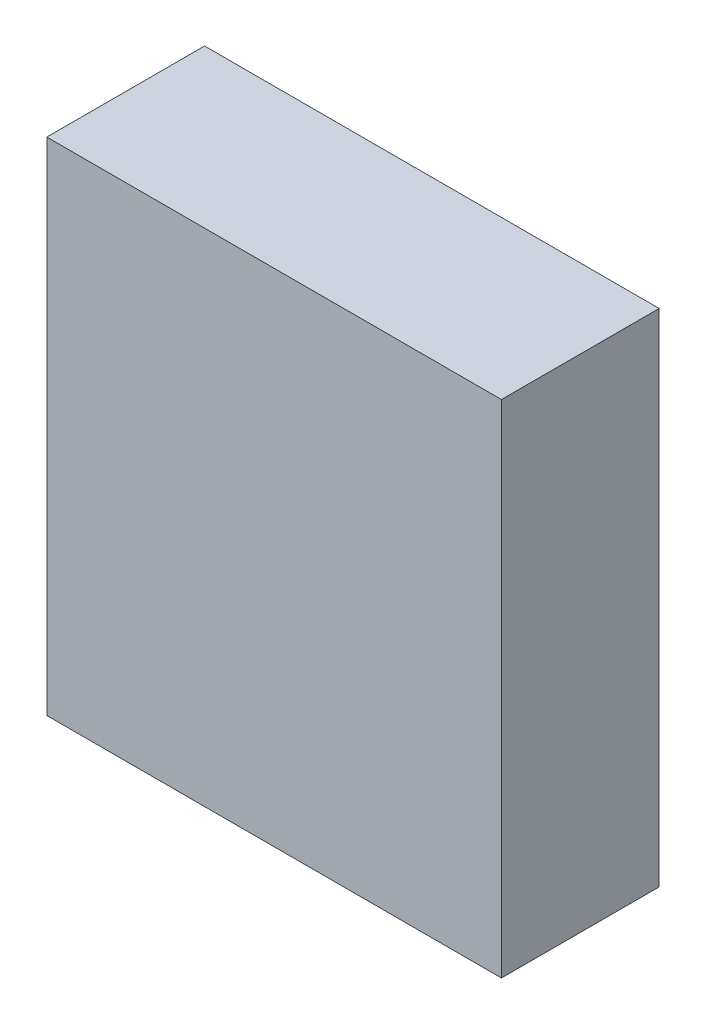
ISO-10303-21;
HEADER;
FILE_DESCRIPTION(('STEP AP214'),'2;1');
FILE_NAME('part.step','',(''),(''),'','','');
FILE_SCHEMA(('AUTOMOTIVE_DESIGN { 1 0 10303 214 1 1 1 1 }'));
ENDSEC;
DATA;
#1=APPLICATION_CONTEXT('core data for automotive mechanical design processes');
#2=APPLICATION_PROTOCOL_DEFINITION('international standard','automotive_design',2000,#1);
#3=PRODUCT_CONTEXT('',#1,'mechanical');
#4=PRODUCT('Part','Part','',(#3));
#5=PRODUCT_RELATED_PRODUCT_CATEGORY('part','',(#4));
#6=PRODUCT_DEFINITION_FORMATION('','',#4);
#7=PRODUCT_DEFINITION_CONTEXT('part definition',#1,'design');
#8=PRODUCT_DEFINITION('design','',#6,#7);
#9=PRODUCT_DEFINITION_SHAPE('','',#8);
#10=(LENGTH_UNIT() NAMED_UNIT(*) SI_UNIT(.MILLI.,.METRE.));
#11=(NAMED_UNIT(*) PLANE_ANGLE_UNIT() SI_UNIT($,.RADIAN.));
#12=(NAMED_UNIT(*) SI_UNIT($,.STERADIAN.) SOLID_ANGLE_UNIT());
#13=UNCERTAINTY_MEASURE_WITH_UNIT(LENGTH_MEASURE(1.E-05),#10,'distance_accuracy_value','');
#14=(GEOMETRIC_REPRESENTATION_CONTEXT(3) GLOBAL_UNCERTAINTY_ASSIGNED_CONTEXT((#13)) GLOBAL_UNIT_ASSIGNED_CONTEXT((#10,
#11,#12)) REPRESENTATION_CONTEXT('',''));
#15=CARTESIAN_POINT('',(0.,0.,0.));
#16=DIRECTION('',(0.,0.,1.));
#17=DIRECTION('',(1.,0.,0.));
#18=AXIS2_PLACEMENT_3D('',#15,#16,#17);
#19=CARTESIAN_POINT('',(-2.44999942429962,2.69998250302808,0.));
#20=DIRECTION('',(-1.,1.19248806385031E-08,0.));
#21=DIRECTION('',(-1.19248806385031E-08,-1.,0.));
#22=AXIS2_PLACEMENT_3D('',#19,#20,#21);
#23=PLANE('',#22);
#24=DIRECTION('',(-1.19248806627069E-08,-1.,0.));
#25=VECTOR('',#24,1.);
#26=CARTESIAN_POINT('',(-2.44999942429962,2.69998250302808,0.));
#27=LINE('',#26,#25);
#28=CARTESIAN_POINT('',(-2.44999942429962,2.69998250302808,0.));
#29=VERTEX_POINT('',#28);
#30=CARTESIAN_POINT('',(-2.4499994886939,-2.70001139345629,0.));
#31=VERTEX_POINT('',#30);
#32=EDGE_CURVE('E11',#29,#31,#27,.T.);
#33=ORIENTED_EDGE('',*,*,#32,.T.);
#34=DIRECTION('',(0.,0.,1.));
#35=VECTOR('',#34,1.);
#36=CARTESIAN_POINT('',(-2.4499994886939,-2.70001139345629,0.));
#37=LINE('',#36,#35);
#38=CARTESIAN_POINT('',(-2.4499994886939,-2.70001139345629,1.6999990940094));
#39=VERTEX_POINT('',#38);
#40=EDGE_CURVE('E88',#31,#39,#37,.T.);
#41=ORIENTED_EDGE('',*,*,#40,.T.);
#42=DIRECTION('',(-1.19248806627069E-08,-1.,0.));
#43=VECTOR('',#42,1.);
#44=CARTESIAN_POINT('',(-2.44999942429962,2.69998250302808,1.6999990940094));
#45=LINE('',#44,#43);
#46=CARTESIAN_POINT('',(-2.44999942429962,2.69998250302808,1.6999990940094));
#47=VERTEX_POINT('',#46);
#48=EDGE_CURVE('E83',#47,#39,#45,.T.);
#49=ORIENTED_EDGE('',*,*,#48,.F.);
#50=DIRECTION('',(0.,0.,1.));
#51=VECTOR('',#50,1.);
#52=CARTESIAN_POINT('',(-2.44999942429962,2.69998250302806,0.));
#53=LINE('',#52,#51);
#54=EDGE_CURVE('E72',#29,#47,#53,.T.);
#55=ORIENTED_EDGE('',*,*,#54,.F.);
#56=EDGE_LOOP('',(#33,#41,#49,#55));
#57=FACE_BOUND('',#56,.T.);
#58=ADVANCED_FACE('F17',(#57),#23,.T.);
#59=CARTESIAN_POINT('',(-2.4499994886939,-2.70001139345629,0.));
#60=DIRECTION('',(-1.19248806385031E-08,-1.,0.));
#61=DIRECTION('',(1.,-1.19248806385031E-08,0.));
#62=AXIS2_PLACEMENT_3D('',#59,#60,#61);
#63=PLANE('',#62);
#64=DIRECTION('',(1.,-1.1924880625848E-08,0.));
#65=VECTOR('',#64,1.);
#66=CARTESIAN_POINT('',(-2.4499994886939,-2.70001139345629,0.));
#67=LINE('',#66,#65);
#68=CARTESIAN_POINT('',(2.44999822248774,-2.7000114518882,0.));
#69=VERTEX_POINT('',#68);
#70=EDGE_CURVE('E24',#31,#69,#67,.T.);
#71=ORIENTED_EDGE('',*,*,#70,.T.);
#72=DIRECTION('',(0.,0.,1.));
#73=VECTOR('',#72,1.);
#74=CARTESIAN_POINT('',(2.44999822248773,-2.70001145188818,0.));
#75=LINE('',#74,#73);
#76=CARTESIAN_POINT('',(2.44999822248774,-2.7000114518882,1.6999990940094));
#77=VERTEX_POINT('',#76);
#78=EDGE_CURVE('E85',#69,#77,#75,.T.);
#79=ORIENTED_EDGE('',*,*,#78,.T.);
#80=DIRECTION('',(1.,-1.1924880625848E-08,0.));
#81=VECTOR('',#80,1.);
#82=CARTESIAN_POINT('',(-2.4499994886939,-2.70001139345629,1.6999990940094));
#83=LINE('',#82,#81);
#84=EDGE_CURVE('E66',#39,#77,#83,.T.);
#85=ORIENTED_EDGE('',*,*,#84,.F.);
#86=ORIENTED_EDGE('',*,*,#40,.F.);
#87=EDGE_LOOP('',(#71,#79,#85,#86));
#88=FACE_BOUND('',#87,.T.);
#89=ADVANCED_FACE('F89',(#88),#63,.T.);
#90=CARTESIAN_POINT('',(2.44999822248774,-2.7000114518882,0.));
#91=DIRECTION('',(1.,-1.19248806385031E-08,0.));
#92=DIRECTION('',(1.19248806385031E-08,1.,0.));
#93=AXIS2_PLACEMENT_3D('',#90,#91,#92);
#94=PLANE('',#93);
#95=DIRECTION('',(1.19248806627069E-08,1.,0.));
#96=VECTOR('',#95,1.);
#97=CARTESIAN_POINT('',(2.44999822248774,-2.7000114518882,0.));
#98=LINE('',#97,#96);
#99=CARTESIAN_POINT('',(2.44999828688201,2.69998244459617,0.));
#100=VERTEX_POINT('',#99);
#101=EDGE_CURVE('E62',#69,#100,#98,.T.);
#102=ORIENTED_EDGE('',*,*,#101,.T.);
#103=DIRECTION('',(0.,0.,1.));
#104=VECTOR('',#103,1.);
#105=CARTESIAN_POINT('',(2.44999828688202,2.69998244459617,0.));
#106=LINE('',#105,#104);
#107=CARTESIAN_POINT('',(2.44999828688201,2.69998244459617,1.6999990940094));
#108=VERTEX_POINT('',#107);
#109=EDGE_CURVE('E55',#100,#108,#106,.T.);
#110=ORIENTED_EDGE('',*,*,#109,.T.);
#111=DIRECTION('',(1.19248806627069E-08,1.,0.));
#112=VECTOR('',#111,1.);
#113=CARTESIAN_POINT('',(2.44999822248774,-2.7000114518882,1.6999990940094));
#114=LINE('',#113,#112);
#115=EDGE_CURVE('E59',#77,#108,#114,.T.);
#116=ORIENTED_EDGE('',*,*,#115,.F.);
#117=ORIENTED_EDGE('',*,*,#78,.F.);
#118=EDGE_LOOP('',(#102,#110,#116,#117));
#119=FACE_BOUND('',#118,.T.);
#120=ADVANCED_FACE('F57',(#119),#94,.T.);
#121=CARTESIAN_POINT('',(2.44999828688201,2.69998244459617,0.));
#122=DIRECTION('',(1.19248806385031E-08,1.,0.));
#123=DIRECTION('',(-1.,1.19248806385031E-08,0.));
#124=AXIS2_PLACEMENT_3D('',#121,#122,#123);
#125=PLANE('',#124);
#126=DIRECTION('',(-1.,1.1924880625848E-08,0.));
#127=VECTOR('',#126,1.);
#128=CARTESIAN_POINT('',(2.44999828688201,2.69998244459617,0.));
#129=LINE('',#128,#127);
#130=EDGE_CURVE('E65',#100,#29,#129,.T.);
#131=ORIENTED_EDGE('',*,*,#130,.T.);
#132=ORIENTED_EDGE('',*,*,#54,.T.);
#133=DIRECTION('',(-1.,1.1924880625848E-08,0.));
#134=VECTOR('',#133,1.);
#135=CARTESIAN_POINT('',(2.44999828688201,2.69998244459617,1.6999990940094));
#136=LINE('',#135,#134);
#137=EDGE_CURVE('E70',#108,#47,#136,.T.);
#138=ORIENTED_EDGE('',*,*,#137,.F.);
#139=ORIENTED_EDGE('',*,*,#109,.F.);
#140=EDGE_LOOP('',(#131,#132,#138,#139));
#141=FACE_BOUND('',#140,.T.);
#142=ADVANCED_FACE('F71',(#141),#125,.T.);
#143=CARTESIAN_POINT('',(65.7749938964844,-429.450012207031,1.6999990940094));
#144=DIRECTION('',(0.,0.,1.));
#145=DIRECTION('',(1.19248806385031E-08,1.,0.));
#146=AXIS2_PLACEMENT_3D('',#143,#144,#145);
#147=PLANE('',#146);
#148=ORIENTED_EDGE('',*,*,#48,.T.);
#149=ORIENTED_EDGE('',*,*,#84,.T.);
#150=ORIENTED_EDGE('',*,*,#115,.T.);
#151=ORIENTED_EDGE('',*,*,#137,.T.);
#152=EDGE_LOOP('',(#148,#149,#150,#151));
#153=FACE_BOUND('',#152,.T.);
#154=ADVANCED_FACE('F76',(#153),#147,.T.);
#155=CARTESIAN_POINT('',(65.7749938964844,-429.450012207031,0.));
#156=DIRECTION('',(0.,0.,1.));
#157=DIRECTION('',(1.19248806385031E-08,1.,0.));
#158=AXIS2_PLACEMENT_3D('',#155,#156,#157);
#159=PLANE('',#158);
#160=ORIENTED_EDGE('',*,*,#130,.F.);
#161=ORIENTED_EDGE('',*,*,#101,.F.);
#162=ORIENTED_EDGE('',*,*,#70,.F.);
#163=ORIENTED_EDGE('',*,*,#32,.F.);
#164=EDGE_LOOP('',(#160,#161,#162,#163));
#165=FACE_BOUND('',#164,.T.);
#166=ADVANCED_FACE('F91',(#165),#159,.F.);
#167=CLOSED_SHELL('',(#58,#89,#120,#142,#154,#166));
#168=MANIFOLD_SOLID_BREP('B1',#167);
#169=ADVANCED_BREP_SHAPE_REPRESENTATION('',(#18,#168),#14);
#170=SHAPE_DEFINITION_REPRESENTATION(#9,#169);
ENDSEC;
END-ISO-10303-21;
